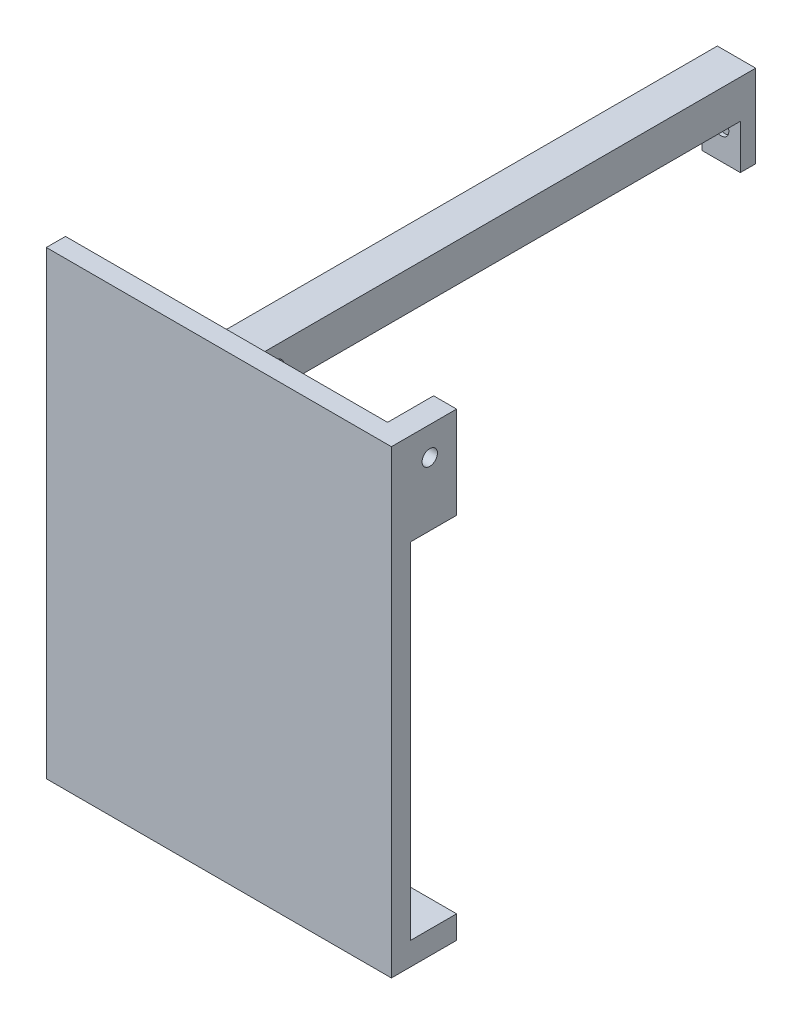
ISO-10303-21;
HEADER;
FILE_DESCRIPTION(('STEP AP214'),'2;1');
FILE_NAME('part.step','',(''),(''),'','','');
FILE_SCHEMA(('AUTOMOTIVE_DESIGN { 1 0 10303 214 1 1 1 1 }'));
ENDSEC;
DATA;
#1=APPLICATION_CONTEXT('core data for automotive mechanical design processes');
#2=APPLICATION_PROTOCOL_DEFINITION('international standard','automotive_design',2000,#1);
#3=PRODUCT_CONTEXT('',#1,'mechanical');
#4=PRODUCT('Part','Part','',(#3));
#5=PRODUCT_RELATED_PRODUCT_CATEGORY('part','',(#4));
#6=PRODUCT_DEFINITION_FORMATION('','',#4);
#7=PRODUCT_DEFINITION_CONTEXT('part definition',#1,'design');
#8=PRODUCT_DEFINITION('design','',#6,#7);
#9=PRODUCT_DEFINITION_SHAPE('','',#8);
#10=(LENGTH_UNIT() NAMED_UNIT(*) SI_UNIT(.MILLI.,.METRE.));
#11=(NAMED_UNIT(*) PLANE_ANGLE_UNIT() SI_UNIT($,.RADIAN.));
#12=(NAMED_UNIT(*) SI_UNIT($,.STERADIAN.) SOLID_ANGLE_UNIT());
#13=UNCERTAINTY_MEASURE_WITH_UNIT(LENGTH_MEASURE(1.E-05),#10,'distance_accuracy_value','');
#14=(GEOMETRIC_REPRESENTATION_CONTEXT(3) GLOBAL_UNCERTAINTY_ASSIGNED_CONTEXT((#13)) GLOBAL_UNIT_ASSIGNED_CONTEXT((#10,
#11,#12)) REPRESENTATION_CONTEXT('',''));
#15=CARTESIAN_POINT('',(0.,0.,0.));
#16=DIRECTION('',(0.,0.,1.));
#17=DIRECTION('',(1.,0.,0.));
#18=AXIS2_PLACEMENT_3D('',#15,#16,#17);
#19=CARTESIAN_POINT('',(0.,0.,650.));
#20=DIRECTION('',(0.,0.,1.));
#21=DIRECTION('',(1.,0.,0.));
#22=AXIS2_PLACEMENT_3D('',#19,#20,#21);
#23=PLANE('',#22);
#24=DIRECTION('',(-1.,0.,0.));
#25=VECTOR('',#24,1.);
#26=CARTESIAN_POINT('',(-35.2150537634409,27.1505376344086,650.));
#27=LINE('',#26,#25);
#28=CARTESIAN_POINT('',(14.7849462365591,27.1505376344086,650.));
#29=VERTEX_POINT('',#28);
#30=CARTESIAN_POINT('',(-35.2150537634409,27.1505376344086,650.));
#31=VERTEX_POINT('',#30);
#32=EDGE_CURVE('E356',#29,#31,#27,.T.);
#33=ORIENTED_EDGE('',*,*,#32,.T.);
#34=DIRECTION('',(0.,-1.,0.));
#35=VECTOR('',#34,1.);
#36=CARTESIAN_POINT('',(-35.2150537634409,27.1505376344086,650.));
#37=LINE('',#36,#35);
#38=CARTESIAN_POINT('',(-35.2150537634409,-22.8494623655914,650.));
#39=VERTEX_POINT('',#38);
#40=EDGE_CURVE('E343',#31,#39,#37,.T.);
#41=ORIENTED_EDGE('',*,*,#40,.T.);
#42=DIRECTION('',(1.,0.,0.));
#43=VECTOR('',#42,1.);
#44=CARTESIAN_POINT('',(-35.2150537634409,-22.8494623655914,650.));
#45=LINE('',#44,#43);
#46=CARTESIAN_POINT('',(14.7849462365592,-22.8494623655914,650.));
#47=VERTEX_POINT('',#46);
#48=EDGE_CURVE('E347',#39,#47,#45,.T.);
#49=ORIENTED_EDGE('',*,*,#48,.T.);
#50=DIRECTION('',(0.,1.,0.));
#51=VECTOR('',#50,1.);
#52=CARTESIAN_POINT('',(14.7849462365591,27.1505376344086,650.));
#53=LINE('',#52,#51);
#54=EDGE_CURVE('E352',#47,#29,#53,.T.);
#55=ORIENTED_EDGE('',*,*,#54,.T.);
#56=EDGE_LOOP('',(#33,#41,#49,#55));
#57=FACE_BOUND('',#56,.T.);
#58=CARTESIAN_POINT('',(-10.2150537634409,-41.8494623655914,650.));
#59=DIRECTION('',(0.,0.,1.));
#60=DIRECTION('',(1.,0.,0.));
#61=AXIS2_PLACEMENT_3D('',#58,#59,#60);
#62=CIRCLE('',#61,10.);
#63=CARTESIAN_POINT('',(-0.215053763440852,-41.8494623655914,650.));
#64=VERTEX_POINT('',#63);
#65=EDGE_CURVE('E208',#64,#64,#62,.F.);
#66=ORIENTED_EDGE('',*,*,#65,.F.);
#67=EDGE_LOOP('',(#66));
#68=FACE_BOUND('',#67,.T.);
#69=DIRECTION('',(0.,1.,0.));
#70=VECTOR('',#69,1.);
#71=CARTESIAN_POINT('',(184.784946236559,-52.8494623655914,650.));
#72=LINE('',#71,#70);
#73=CARTESIAN_POINT('',(184.784946236559,-52.8494623655914,650.));
#74=VERTEX_POINT('',#73);
#75=CARTESIAN_POINT('',(184.784946236559,37.1505376344087,650.));
#76=VERTEX_POINT('',#75);
#77=EDGE_CURVE('E170',#74,#76,#72,.T.);
#78=ORIENTED_EDGE('',*,*,#77,.F.);
#79=DIRECTION('',(1.,0.,0.));
#80=VECTOR('',#79,1.);
#81=CARTESIAN_POINT('',(214.784946236559,-52.8494623655914,650.));
#82=LINE('',#81,#80);
#83=CARTESIAN_POINT('',(-235.215053763441,-52.8494623655914,650.));
#84=VERTEX_POINT('',#83);
#85=EDGE_CURVE('E262',#84,#74,#82,.T.);
#86=ORIENTED_EDGE('',*,*,#85,.F.);
#87=DIRECTION('',(0.,-1.,0.));
#88=VECTOR('',#87,1.);
#89=CARTESIAN_POINT('',(-235.215053763441,37.1505376344086,650.));
#90=LINE('',#89,#88);
#91=CARTESIAN_POINT('',(-235.215053763441,37.1505376344086,650.));
#92=VERTEX_POINT('',#91);
#93=EDGE_CURVE('E321',#92,#84,#90,.T.);
#94=ORIENTED_EDGE('',*,*,#93,.F.);
#95=DIRECTION('',(-1.,0.,0.));
#96=VECTOR('',#95,1.);
#97=CARTESIAN_POINT('',(-235.215053763441,37.1505376344086,650.));
#98=LINE('',#97,#96);
#99=EDGE_CURVE('E311',#76,#92,#98,.T.);
#100=ORIENTED_EDGE('',*,*,#99,.F.);
#101=EDGE_LOOP('',(#78,#86,#94,#100));
#102=FACE_BOUND('',#101,.T.);
#103=ADVANCED_FACE('F46',(#57,#68,#102),#23,.F.);
#104=CARTESIAN_POINT('',(214.784946236559,-52.8494623655914,590.));
#105=DIRECTION('',(0.,-1.,0.));
#106=DIRECTION('',(0.,0.,-1.));
#107=AXIS2_PLACEMENT_3D('',#104,#105,#106);
#108=PLANE('',#107);
#109=CARTESIAN_POINT('',(-10.2150537634408,-52.8494623655914,625.));
#110=DIRECTION('',(0.,-1.,0.));
#111=DIRECTION('',(0.,0.,-1.));
#112=AXIS2_PLACEMENT_3D('',#109,#110,#111);
#113=CIRCLE('',#112,10.);
#114=CARTESIAN_POINT('',(-10.2150537634408,-52.8494623655914,615.));
#115=VERTEX_POINT('',#114);
#116=EDGE_CURVE('E240',#115,#115,#113,.F.);
#117=ORIENTED_EDGE('',*,*,#116,.F.);
#118=EDGE_LOOP('',(#117));
#119=FACE_BOUND('',#118,.T.);
#120=DIRECTION('',(0.,0.,1.));
#121=VECTOR('',#120,1.);
#122=CARTESIAN_POINT('',(184.784946236559,-52.8494623655914,495.131670194949));
#123=LINE('',#122,#121);
#124=CARTESIAN_POINT('',(184.784946236559,-52.8494623655914,590.));
#125=VERTEX_POINT('',#124);
#126=EDGE_CURVE('E200',#125,#74,#123,.T.);
#127=ORIENTED_EDGE('',*,*,#126,.F.);
#128=DIRECTION('',(1.,0.,0.));
#129=VECTOR('',#128,1.);
#130=CARTESIAN_POINT('',(214.784946236559,-52.8494623655914,590.));
#131=LINE('',#130,#129);
#132=CARTESIAN_POINT('',(-235.215053763441,-52.8494623655914,590.));
#133=VERTEX_POINT('',#132);
#134=EDGE_CURVE('E189',#133,#125,#131,.T.);
#135=ORIENTED_EDGE('',*,*,#134,.F.);
#136=DIRECTION('',(0.,0.,1.));
#137=VECTOR('',#136,1.);
#138=CARTESIAN_POINT('',(-235.215053763441,-52.8494623655914,590.));
#139=LINE('',#138,#137);
#140=EDGE_CURVE('E259',#133,#84,#139,.T.);
#141=ORIENTED_EDGE('',*,*,#140,.T.);
#142=ORIENTED_EDGE('',*,*,#85,.T.);
#143=EDGE_LOOP('',(#127,#135,#141,#142));
#144=FACE_BOUND('',#143,.T.);
#145=ADVANCED_FACE('F422',(#119,#144),#108,.F.);
#146=CARTESIAN_POINT('',(-35.2150537634409,-22.8494623655914,650.));
#147=DIRECTION('',(0.,1.,0.));
#148=DIRECTION('',(0.,0.,1.));
#149=AXIS2_PLACEMENT_3D('',#146,#147,#148);
#150=PLANE('',#149);
#151=DIRECTION('',(-1.,0.,0.));
#152=VECTOR('',#151,1.);
#153=CARTESIAN_POINT('',(-35.2150537634409,-22.8494623655914,20.));
#154=LINE('',#153,#152);
#155=CARTESIAN_POINT('',(14.7849462365592,-22.8494623655914,20.));
#156=VERTEX_POINT('',#155);
#157=CARTESIAN_POINT('',(-35.2150537634409,-22.8494623655914,20.));
#158=VERTEX_POINT('',#157);
#159=EDGE_CURVE('E66',#156,#158,#154,.T.);
#160=ORIENTED_EDGE('',*,*,#159,.F.);
#161=DIRECTION('',(0.,0.,-1.));
#162=VECTOR('',#161,1.);
#163=CARTESIAN_POINT('',(14.7849462365592,-22.8494623655914,650.));
#164=LINE('',#163,#162);
#165=EDGE_CURVE('E56',#47,#156,#164,.T.);
#166=ORIENTED_EDGE('',*,*,#165,.F.);
#167=ORIENTED_EDGE('',*,*,#48,.F.);
#168=DIRECTION('',(0.,0.,-1.));
#169=VECTOR('',#168,1.);
#170=CARTESIAN_POINT('',(-35.2150537634409,-22.8494623655914,650.));
#171=LINE('',#170,#169);
#172=EDGE_CURVE('E11',#39,#158,#171,.T.);
#173=ORIENTED_EDGE('',*,*,#172,.T.);
#174=EDGE_LOOP('',(#160,#166,#167,#173));
#175=FACE_BOUND('',#174,.T.);
#176=ADVANCED_FACE('F400',(#175),#150,.F.);
#177=DIRECTION('',(-1.,0.,0.));
#178=VECTOR('',#177,1.);
#179=CARTESIAN_POINT('',(214.784946236559,-82.8494623655914,650.));
#180=LINE('',#179,#178);
#181=CARTESIAN_POINT('',(214.784946236559,-82.8494623655914,650.));
#182=VERTEX_POINT('',#181);
#183=CARTESIAN_POINT('',(-235.215053763441,-82.8494623655914,650.));
#184=VERTEX_POINT('',#183);
#185=EDGE_CURVE('E266',#182,#184,#180,.T.);
#186=ORIENTED_EDGE('',*,*,#185,.F.);
#187=DIRECTION('',(0.,1.,0.));
#188=VECTOR('',#187,1.);
#189=CARTESIAN_POINT('',(214.784946236559,37.1505376344087,650.));
#190=LINE('',#189,#188);
#191=CARTESIAN_POINT('',(214.784946236559,-532.849462365591,650.));
#192=VERTEX_POINT('',#191);
#193=EDGE_CURVE('E325',#192,#182,#190,.T.);
#194=ORIENTED_EDGE('',*,*,#193,.F.);
#195=DIRECTION('',(1.,0.,0.));
#196=VECTOR('',#195,1.);
#197=CARTESIAN_POINT('',(214.784946236559,-532.849462365591,650.));
#198=LINE('',#197,#196);
#199=CARTESIAN_POINT('',(-235.215053763441,-532.849462365591,650.));
#200=VERTEX_POINT('',#199);
#201=EDGE_CURVE('E270',#200,#192,#198,.T.);
#202=ORIENTED_EDGE('',*,*,#201,.F.);
#203=EDGE_CURVE('E305',#184,#200,#90,.T.);
#204=ORIENTED_EDGE('',*,*,#203,.F.);
#205=EDGE_LOOP('',(#186,#194,#202,#204));
#206=FACE_BOUND('',#205,.T.);
#207=ADVANCED_FACE('F424',(#206),#23,.F.);
#208=CARTESIAN_POINT('',(-35.2150537634409,27.1505376344086,650.));
#209=DIRECTION('',(1.,0.,0.));
#210=DIRECTION('',(0.,0.,-1.));
#211=AXIS2_PLACEMENT_3D('',#208,#209,#210);
#212=PLANE('',#211);
#213=DIRECTION('',(0.,-1.,0.));
#214=VECTOR('',#213,1.);
#215=CARTESIAN_POINT('',(-35.2150537634409,27.1505376344086,0.));
#216=LINE('',#215,#214);
#217=CARTESIAN_POINT('',(-35.2150537634409,27.1505376344086,0.));
#218=VERTEX_POINT('',#217);
#219=CARTESIAN_POINT('',(-35.2150537634409,-80.8494623655914,0.));
#220=VERTEX_POINT('',#219);
#221=EDGE_CURVE('E342',#218,#220,#216,.T.);
#222=ORIENTED_EDGE('',*,*,#221,.T.);
#223=DIRECTION('',(0.,0.,-1.));
#224=VECTOR('',#223,1.);
#225=CARTESIAN_POINT('',(-35.2150537634409,-80.8494623655914,0.));
#226=LINE('',#225,#224);
#227=CARTESIAN_POINT('',(-35.2150537634409,-80.8494623655914,20.));
#228=VERTEX_POINT('',#227);
#229=EDGE_CURVE('E212',#228,#220,#226,.T.);
#230=ORIENTED_EDGE('',*,*,#229,.F.);
#231=DIRECTION('',(0.,1.,0.));
#232=VECTOR('',#231,1.);
#233=CARTESIAN_POINT('',(-35.2150537634409,-80.8494623655914,20.));
#234=LINE('',#233,#232);
#235=EDGE_CURVE('E226',#228,#158,#234,.T.);
#236=ORIENTED_EDGE('',*,*,#235,.T.);
#237=ORIENTED_EDGE('',*,*,#172,.F.);
#238=ORIENTED_EDGE('',*,*,#40,.F.);
#239=DIRECTION('',(0.,0.,-1.));
#240=VECTOR('',#239,1.);
#241=CARTESIAN_POINT('',(-35.2150537634409,27.1505376344086,650.));
#242=LINE('',#241,#240);
#243=EDGE_CURVE('E360',#31,#218,#242,.T.);
#244=ORIENTED_EDGE('',*,*,#243,.T.);
#245=EDGE_LOOP('',(#222,#230,#236,#237,#238,#244));
#246=FACE_BOUND('',#245,.T.);
#247=ADVANCED_FACE('F48',(#246),#212,.F.);
#248=CARTESIAN_POINT('',(14.7849462365591,27.1505376344086,650.));
#249=DIRECTION('',(-1.,0.,0.));
#250=DIRECTION('',(0.,-1.,0.));
#251=AXIS2_PLACEMENT_3D('',#248,#249,#250);
#252=PLANE('',#251);
#253=CARTESIAN_POINT('',(14.7849462365591,0.,625.));
#254=DIRECTION('',(-1.,0.,0.));
#255=DIRECTION('',(0.,-1.,0.));
#256=AXIS2_PLACEMENT_3D('',#253,#254,#255);
#257=CIRCLE('',#256,9.99999999999998);
#258=CARTESIAN_POINT('',(14.7849462365592,-9.99999999999998,625.));
#259=VERTEX_POINT('',#258);
#260=EDGE_CURVE('E202',#259,#259,#257,.T.);
#261=ORIENTED_EDGE('',*,*,#260,.T.);
#262=EDGE_LOOP('',(#261));
#263=FACE_BOUND('',#262,.T.);
#264=DIRECTION('',(0.,1.,0.));
#265=VECTOR('',#264,1.);
#266=CARTESIAN_POINT('',(14.7849462365591,27.1505376344086,0.));
#267=LINE('',#266,#265);
#268=CARTESIAN_POINT('',(14.7849462365592,-80.8494623655914,0.));
#269=VERTEX_POINT('',#268);
#270=CARTESIAN_POINT('',(14.7849462365591,27.1505376344086,0.));
#271=VERTEX_POINT('',#270);
#272=EDGE_CURVE('E363',#269,#271,#267,.T.);
#273=ORIENTED_EDGE('',*,*,#272,.T.);
#274=DIRECTION('',(0.,0.,-1.));
#275=VECTOR('',#274,1.);
#276=CARTESIAN_POINT('',(14.7849462365591,27.1505376344086,650.));
#277=LINE('',#276,#275);
#278=EDGE_CURVE('E371',#29,#271,#277,.T.);
#279=ORIENTED_EDGE('',*,*,#278,.F.);
#280=ORIENTED_EDGE('',*,*,#54,.F.);
#281=ORIENTED_EDGE('',*,*,#165,.T.);
#282=DIRECTION('',(0.,1.,0.));
#283=VECTOR('',#282,1.);
#284=CARTESIAN_POINT('',(14.7849462365592,-80.8494623655914,20.));
#285=LINE('',#284,#283);
#286=CARTESIAN_POINT('',(14.7849462365592,-80.8494623655914,20.));
#287=VERTEX_POINT('',#286);
#288=EDGE_CURVE('E232',#287,#156,#285,.T.);
#289=ORIENTED_EDGE('',*,*,#288,.F.);
#290=DIRECTION('',(0.,0.,1.));
#291=VECTOR('',#290,1.);
#292=CARTESIAN_POINT('',(14.7849462365592,-80.8494623655914,0.));
#293=LINE('',#292,#291);
#294=EDGE_CURVE('E220',#269,#287,#293,.T.);
#295=ORIENTED_EDGE('',*,*,#294,.F.);
#296=EDGE_LOOP('',(#273,#279,#280,#281,#289,#295));
#297=FACE_BOUND('',#296,.T.);
#298=ADVANCED_FACE('F398',(#263,#297),#252,.F.);
#299=CARTESIAN_POINT('',(-35.2150537634409,27.1505376344086,650.));
#300=DIRECTION('',(0.,-1.,0.));
#301=DIRECTION('',(0.,0.,-1.));
#302=AXIS2_PLACEMENT_3D('',#299,#300,#301);
#303=PLANE('',#302);
#304=DIRECTION('',(-1.,0.,0.));
#305=VECTOR('',#304,1.);
#306=CARTESIAN_POINT('',(-35.2150537634409,27.1505376344086,0.));
#307=LINE('',#306,#305);
#308=EDGE_CURVE('E348',#271,#218,#307,.T.);
#309=ORIENTED_EDGE('',*,*,#308,.T.);
#310=ORIENTED_EDGE('',*,*,#243,.F.);
#311=ORIENTED_EDGE('',*,*,#32,.F.);
#312=ORIENTED_EDGE('',*,*,#278,.T.);
#313=EDGE_LOOP('',(#309,#310,#311,#312));
#314=FACE_BOUND('',#313,.T.);
#315=ADVANCED_FACE('F406',(#314),#303,.F.);
#316=CARTESIAN_POINT('',(0.,0.,0.));
#317=DIRECTION('',(0.,0.,1.));
#318=DIRECTION('',(1.,0.,0.));
#319=AXIS2_PLACEMENT_3D('',#316,#317,#318);
#320=PLANE('',#319);
#321=ORIENTED_EDGE('',*,*,#221,.F.);
#322=ORIENTED_EDGE('',*,*,#308,.F.);
#323=ORIENTED_EDGE('',*,*,#272,.F.);
#324=DIRECTION('',(1.,0.,0.));
#325=VECTOR('',#324,1.);
#326=CARTESIAN_POINT('',(-35.2150537634409,-80.8494623655914,0.));
#327=LINE('',#326,#325);
#328=EDGE_CURVE('E216',#220,#269,#327,.T.);
#329=ORIENTED_EDGE('',*,*,#328,.F.);
#330=EDGE_LOOP('',(#321,#322,#323,#329));
#331=FACE_BOUND('',#330,.T.);
#332=ADVANCED_FACE('F409',(#331),#320,.F.);
#333=CARTESIAN_POINT('',(-235.215053763441,37.1505376344086,675.));
#334=DIRECTION('',(1.,0.,0.));
#335=DIRECTION('',(0.,1.,0.));
#336=AXIS2_PLACEMENT_3D('',#333,#334,#335);
#337=PLANE('',#336);
#338=ORIENTED_EDGE('',*,*,#93,.T.);
#339=ORIENTED_EDGE('',*,*,#140,.F.);
#340=DIRECTION('',(0.,1.,0.));
#341=VECTOR('',#340,1.);
#342=CARTESIAN_POINT('',(-235.215053763441,-52.8494623655914,590.));
#343=LINE('',#342,#341);
#344=CARTESIAN_POINT('',(-235.215053763441,-82.8494623655914,590.));
#345=VERTEX_POINT('',#344);
#346=EDGE_CURVE('E273',#345,#133,#343,.T.);
#347=ORIENTED_EDGE('',*,*,#346,.F.);
#348=DIRECTION('',(0.,0.,1.));
#349=VECTOR('',#348,1.);
#350=CARTESIAN_POINT('',(-235.215053763441,-82.8494623655914,590.));
#351=LINE('',#350,#349);
#352=EDGE_CURVE('E255',#345,#184,#351,.T.);
#353=ORIENTED_EDGE('',*,*,#352,.T.);
#354=ORIENTED_EDGE('',*,*,#203,.T.);
#355=DIRECTION('',(0.,0.,1.));
#356=VECTOR('',#355,1.);
#357=CARTESIAN_POINT('',(-235.215053763441,-532.849462365591,590.));
#358=LINE('',#357,#356);
#359=CARTESIAN_POINT('',(-235.215053763441,-532.849462365591,590.));
#360=VERTEX_POINT('',#359);
#361=EDGE_CURVE('E301',#360,#200,#358,.T.);
#362=ORIENTED_EDGE('',*,*,#361,.F.);
#363=DIRECTION('',(0.,1.,0.));
#364=VECTOR('',#363,1.);
#365=CARTESIAN_POINT('',(-235.215053763441,-562.849462365591,590.));
#366=LINE('',#365,#364);
#367=CARTESIAN_POINT('',(-235.215053763441,-562.849462365591,590.));
#368=VERTEX_POINT('',#367);
#369=EDGE_CURVE('E289',#368,#360,#366,.T.);
#370=ORIENTED_EDGE('',*,*,#369,.F.);
#371=DIRECTION('',(0.,0.,-1.));
#372=VECTOR('',#371,1.);
#373=CARTESIAN_POINT('',(-235.215053763441,-562.849462365591,675.));
#374=LINE('',#373,#372);
#375=CARTESIAN_POINT('',(-235.215053763441,-562.849462365591,675.));
#376=VERTEX_POINT('',#375);
#377=EDGE_CURVE('E339',#376,#368,#374,.T.);
#378=ORIENTED_EDGE('',*,*,#377,.F.);
#379=DIRECTION('',(0.,-1.,0.));
#380=VECTOR('',#379,1.);
#381=CARTESIAN_POINT('',(-235.215053763441,37.1505376344086,675.));
#382=LINE('',#381,#380);
#383=CARTESIAN_POINT('',(-235.215053763441,37.1505376344086,675.));
#384=VERTEX_POINT('',#383);
#385=EDGE_CURVE('E306',#384,#376,#382,.T.);
#386=ORIENTED_EDGE('',*,*,#385,.F.);
#387=DIRECTION('',(0.,0.,-1.));
#388=VECTOR('',#387,1.);
#389=CARTESIAN_POINT('',(-235.215053763441,37.1505376344086,675.));
#390=LINE('',#389,#388);
#391=EDGE_CURVE('E320',#384,#92,#390,.T.);
#392=ORIENTED_EDGE('',*,*,#391,.T.);
#393=EDGE_LOOP('',(#338,#339,#347,#353,#354,#362,#370,#378,#386,#392));
#394=FACE_BOUND('',#393,.T.);
#395=ADVANCED_FACE('F411',(#394),#337,.F.);
#396=CARTESIAN_POINT('',(-235.215053763441,-562.849462365591,675.));
#397=DIRECTION('',(0.,1.,0.));
#398=DIRECTION('',(0.,0.,1.));
#399=AXIS2_PLACEMENT_3D('',#396,#397,#398);
#400=PLANE('',#399);
#401=CARTESIAN_POINT('',(-10.2150537634408,-562.849462365591,625.));
#402=DIRECTION('',(0.,-1.,0.));
#403=DIRECTION('',(0.,0.,-1.));
#404=AXIS2_PLACEMENT_3D('',#401,#402,#403);
#405=CIRCLE('',#404,10.);
#406=CARTESIAN_POINT('',(-10.2150537634408,-562.849462365591,615.));
#407=VERTEX_POINT('',#406);
#408=EDGE_CURVE('E236',#407,#407,#405,.T.);
#409=ORIENTED_EDGE('',*,*,#408,.F.);
#410=EDGE_LOOP('',(#409));
#411=FACE_BOUND('',#410,.T.);
#412=ORIENTED_EDGE('',*,*,#377,.T.);
#413=DIRECTION('',(-1.,0.,0.));
#414=VECTOR('',#413,1.);
#415=CARTESIAN_POINT('',(214.784946236559,-562.849462365591,590.));
#416=LINE('',#415,#414);
#417=CARTESIAN_POINT('',(214.784946236559,-562.849462365591,590.));
#418=VERTEX_POINT('',#417);
#419=EDGE_CURVE('E285',#418,#368,#416,.T.);
#420=ORIENTED_EDGE('',*,*,#419,.F.);
#421=DIRECTION('',(0.,0.,-1.));
#422=VECTOR('',#421,1.);
#423=CARTESIAN_POINT('',(214.784946236559,-562.849462365591,675.));
#424=LINE('',#423,#422);
#425=CARTESIAN_POINT('',(214.784946236559,-562.849462365591,675.));
#426=VERTEX_POINT('',#425);
#427=EDGE_CURVE('E336',#426,#418,#424,.T.);
#428=ORIENTED_EDGE('',*,*,#427,.F.);
#429=DIRECTION('',(1.,0.,0.));
#430=VECTOR('',#429,1.);
#431=CARTESIAN_POINT('',(-235.215053763441,-562.849462365591,675.));
#432=LINE('',#431,#430);
#433=EDGE_CURVE('E310',#376,#426,#432,.T.);
#434=ORIENTED_EDGE('',*,*,#433,.F.);
#435=EDGE_LOOP('',(#412,#420,#428,#434));
#436=FACE_BOUND('',#435,.T.);
#437=ADVANCED_FACE('F417',(#411,#436),#400,.F.);
#438=CARTESIAN_POINT('',(214.784946236559,37.1505376344087,675.));
#439=DIRECTION('',(-1.,0.,0.));
#440=DIRECTION('',(0.,-1.,0.));
#441=AXIS2_PLACEMENT_3D('',#438,#439,#440);
#442=PLANE('',#441);
#443=CARTESIAN_POINT('',(214.784946236559,0.,625.));
#444=DIRECTION('',(1.,0.,0.));
#445=DIRECTION('',(0.,1.,0.));
#446=AXIS2_PLACEMENT_3D('',#443,#444,#445);
#447=CIRCLE('',#446,9.99999999999998);
#448=CARTESIAN_POINT('',(214.784946236559,10.,625.));
#449=VERTEX_POINT('',#448);
#450=EDGE_CURVE('E537',#449,#449,#447,.T.);
#451=ORIENTED_EDGE('',*,*,#450,.F.);
#452=EDGE_LOOP('',(#451));
#453=FACE_BOUND('',#452,.T.);
#454=DIRECTION('',(0.,-1.,0.));
#455=VECTOR('',#454,1.);
#456=CARTESIAN_POINT('',(214.784946236559,-52.8494623655914,590.));
#457=LINE('',#456,#455);
#458=CARTESIAN_POINT('',(214.784946236559,37.1505376344087,590.));
#459=VERTEX_POINT('',#458);
#460=CARTESIAN_POINT('',(214.784946236559,-82.8494623655914,590.));
#461=VERTEX_POINT('',#460);
#462=EDGE_CURVE('E267',#459,#461,#457,.T.);
#463=ORIENTED_EDGE('',*,*,#462,.F.);
#464=DIRECTION('',(0.,0.,-1.));
#465=VECTOR('',#464,1.);
#466=CARTESIAN_POINT('',(214.784946236559,37.1505376344087,675.));
#467=LINE('',#466,#465);
#468=CARTESIAN_POINT('',(214.784946236559,37.1505376344087,675.));
#469=VERTEX_POINT('',#468);
#470=EDGE_CURVE('E180',#469,#459,#467,.T.);
#471=ORIENTED_EDGE('',*,*,#470,.F.);
#472=DIRECTION('',(0.,1.,0.));
#473=VECTOR('',#472,1.);
#474=CARTESIAN_POINT('',(214.784946236559,37.1505376344087,675.));
#475=LINE('',#474,#473);
#476=EDGE_CURVE('E314',#426,#469,#475,.T.);
#477=ORIENTED_EDGE('',*,*,#476,.F.);
#478=ORIENTED_EDGE('',*,*,#427,.T.);
#479=DIRECTION('',(0.,-1.,0.));
#480=VECTOR('',#479,1.);
#481=CARTESIAN_POINT('',(214.784946236559,-562.849462365591,590.));
#482=LINE('',#481,#480);
#483=CARTESIAN_POINT('',(214.784946236559,-532.849462365591,590.));
#484=VERTEX_POINT('',#483);
#485=EDGE_CURVE('E281',#484,#418,#482,.T.);
#486=ORIENTED_EDGE('',*,*,#485,.F.);
#487=DIRECTION('',(0.,0.,1.));
#488=VECTOR('',#487,1.);
#489=CARTESIAN_POINT('',(214.784946236559,-532.849462365591,590.));
#490=LINE('',#489,#488);
#491=EDGE_CURVE('E295',#484,#192,#490,.T.);
#492=ORIENTED_EDGE('',*,*,#491,.T.);
#493=ORIENTED_EDGE('',*,*,#193,.T.);
#494=DIRECTION('',(0.,0.,1.));
#495=VECTOR('',#494,1.);
#496=CARTESIAN_POINT('',(214.784946236559,-82.8494623655914,590.));
#497=LINE('',#496,#495);
#498=EDGE_CURVE('E252',#461,#182,#497,.T.);
#499=ORIENTED_EDGE('',*,*,#498,.F.);
#500=EDGE_LOOP('',(#463,#471,#477,#478,#486,#492,#493,#499));
#501=FACE_BOUND('',#500,.T.);
#502=ADVANCED_FACE('F446',(#453,#501),#442,.F.);
#503=CARTESIAN_POINT('',(-235.215053763441,37.1505376344086,675.));
#504=DIRECTION('',(0.,-1.,0.));
#505=DIRECTION('',(1.,0.,0.));
#506=AXIS2_PLACEMENT_3D('',#503,#504,#505);
#507=PLANE('',#506);
#508=ORIENTED_EDGE('',*,*,#470,.T.);
#509=DIRECTION('',(1.,0.,0.));
#510=VECTOR('',#509,1.);
#511=CARTESIAN_POINT('',(214.784946236559,37.1505376344087,590.));
#512=LINE('',#511,#510);
#513=CARTESIAN_POINT('',(184.784946236559,37.1505376344087,590.));
#514=VERTEX_POINT('',#513);
#515=EDGE_CURVE('E174',#514,#459,#512,.T.);
#516=ORIENTED_EDGE('',*,*,#515,.F.);
#517=DIRECTION('',(0.,0.,1.));
#518=VECTOR('',#517,1.);
#519=CARTESIAN_POINT('',(184.784946236559,37.1505376344087,495.131670194949));
#520=LINE('',#519,#518);
#521=EDGE_CURVE('E163',#514,#76,#520,.T.);
#522=ORIENTED_EDGE('',*,*,#521,.T.);
#523=ORIENTED_EDGE('',*,*,#99,.T.);
#524=ORIENTED_EDGE('',*,*,#391,.F.);
#525=DIRECTION('',(-1.,0.,0.));
#526=VECTOR('',#525,1.);
#527=CARTESIAN_POINT('',(-235.215053763441,37.1505376344086,675.));
#528=LINE('',#527,#526);
#529=EDGE_CURVE('E317',#469,#384,#528,.T.);
#530=ORIENTED_EDGE('',*,*,#529,.F.);
#531=EDGE_LOOP('',(#508,#516,#522,#523,#524,#530));
#532=FACE_BOUND('',#531,.T.);
#533=ADVANCED_FACE('F177',(#532),#507,.F.);
#534=CARTESIAN_POINT('',(0.,0.,675.));
#535=DIRECTION('',(0.,0.,1.));
#536=DIRECTION('',(1.,0.,0.));
#537=AXIS2_PLACEMENT_3D('',#534,#535,#536);
#538=PLANE('',#537);
#539=ORIENTED_EDGE('',*,*,#385,.T.);
#540=ORIENTED_EDGE('',*,*,#433,.T.);
#541=ORIENTED_EDGE('',*,*,#476,.T.);
#542=ORIENTED_EDGE('',*,*,#529,.T.);
#543=EDGE_LOOP('',(#539,#540,#541,#542));
#544=FACE_BOUND('',#543,.T.);
#545=ADVANCED_FACE('F463',(#544),#538,.T.);
#546=CARTESIAN_POINT('',(214.784946236559,-532.849462365591,590.));
#547=DIRECTION('',(0.,-1.,0.));
#548=DIRECTION('',(0.,0.,-1.));
#549=AXIS2_PLACEMENT_3D('',#546,#547,#548);
#550=PLANE('',#549);
#551=CARTESIAN_POINT('',(-10.2150537634408,-532.849462365591,625.));
#552=DIRECTION('',(0.,-1.,0.));
#553=DIRECTION('',(0.,0.,-1.));
#554=AXIS2_PLACEMENT_3D('',#551,#552,#553);
#555=CIRCLE('',#554,10.);
#556=CARTESIAN_POINT('',(-10.2150537634408,-532.849462365591,615.));
#557=VERTEX_POINT('',#556);
#558=EDGE_CURVE('E248',#557,#557,#555,.T.);
#559=ORIENTED_EDGE('',*,*,#558,.T.);
#560=EDGE_LOOP('',(#559));
#561=FACE_BOUND('',#560,.T.);
#562=ORIENTED_EDGE('',*,*,#201,.T.);
#563=ORIENTED_EDGE('',*,*,#491,.F.);
#564=DIRECTION('',(1.,0.,0.));
#565=VECTOR('',#564,1.);
#566=CARTESIAN_POINT('',(214.784946236559,-532.849462365591,590.));
#567=LINE('',#566,#565);
#568=EDGE_CURVE('E292',#360,#484,#567,.T.);
#569=ORIENTED_EDGE('',*,*,#568,.F.);
#570=ORIENTED_EDGE('',*,*,#361,.T.);
#571=EDGE_LOOP('',(#562,#563,#569,#570));
#572=FACE_BOUND('',#571,.T.);
#573=ADVANCED_FACE('F451',(#561,#572),#550,.F.);
#574=CARTESIAN_POINT('',(0.,0.,590.));
#575=DIRECTION('',(0.,0.,1.));
#576=DIRECTION('',(1.,0.,0.));
#577=AXIS2_PLACEMENT_3D('',#574,#575,#576);
#578=PLANE('',#577);
#579=ORIENTED_EDGE('',*,*,#485,.T.);
#580=ORIENTED_EDGE('',*,*,#419,.T.);
#581=ORIENTED_EDGE('',*,*,#369,.T.);
#582=ORIENTED_EDGE('',*,*,#568,.T.);
#583=EDGE_LOOP('',(#579,#580,#581,#582));
#584=FACE_BOUND('',#583,.T.);
#585=ADVANCED_FACE('F468',(#584),#578,.F.);
#586=CARTESIAN_POINT('',(214.784946236559,-82.8494623655914,590.));
#587=DIRECTION('',(0.,1.,0.));
#588=DIRECTION('',(0.,0.,1.));
#589=AXIS2_PLACEMENT_3D('',#586,#587,#588);
#590=PLANE('',#589);
#591=CARTESIAN_POINT('',(-10.2150537634408,-82.8494623655914,625.));
#592=DIRECTION('',(0.,1.,0.));
#593=DIRECTION('',(0.,0.,1.));
#594=AXIS2_PLACEMENT_3D('',#591,#592,#593);
#595=CIRCLE('',#594,10.);
#596=CARTESIAN_POINT('',(-10.2150537634408,-82.8494623655914,635.));
#597=VERTEX_POINT('',#596);
#598=EDGE_CURVE('E244',#597,#597,#595,.T.);
#599=ORIENTED_EDGE('',*,*,#598,.T.);
#600=EDGE_LOOP('',(#599));
#601=FACE_BOUND('',#600,.T.);
#602=ORIENTED_EDGE('',*,*,#185,.T.);
#603=ORIENTED_EDGE('',*,*,#352,.F.);
#604=DIRECTION('',(-1.,0.,0.));
#605=VECTOR('',#604,1.);
#606=CARTESIAN_POINT('',(214.784946236559,-82.8494623655914,590.));
#607=LINE('',#606,#605);
#608=EDGE_CURVE('E276',#461,#345,#607,.T.);
#609=ORIENTED_EDGE('',*,*,#608,.F.);
#610=ORIENTED_EDGE('',*,*,#498,.T.);
#611=EDGE_LOOP('',(#602,#603,#609,#610));
#612=FACE_BOUND('',#611,.T.);
#613=ADVANCED_FACE('F458',(#601,#612),#590,.F.);
#614=CARTESIAN_POINT('',(0.,0.,590.));
#615=DIRECTION('',(0.,0.,-1.));
#616=DIRECTION('',(-1.,0.,0.));
#617=AXIS2_PLACEMENT_3D('',#614,#615,#616);
#618=PLANE('',#617);
#619=ORIENTED_EDGE('',*,*,#462,.T.);
#620=ORIENTED_EDGE('',*,*,#608,.T.);
#621=ORIENTED_EDGE('',*,*,#346,.T.);
#622=ORIENTED_EDGE('',*,*,#134,.T.);
#623=DIRECTION('',(0.,1.,0.));
#624=VECTOR('',#623,1.);
#625=CARTESIAN_POINT('',(184.784946236559,-52.8494623655914,590.));
#626=LINE('',#625,#624);
#627=EDGE_CURVE('E167',#125,#514,#626,.T.);
#628=ORIENTED_EDGE('',*,*,#627,.T.);
#629=ORIENTED_EDGE('',*,*,#515,.T.);
#630=EDGE_LOOP('',(#619,#620,#621,#622,#628,#629));
#631=FACE_BOUND('',#630,.T.);
#632=ADVANCED_FACE('F187',(#631),#618,.T.);
#633=CARTESIAN_POINT('',(-10.2150537634408,-24.5651911181294,625.));
#634=DIRECTION('',(0.,-1.,0.));
#635=DIRECTION('',(0.,0.,-1.));
#636=AXIS2_PLACEMENT_3D('',#633,#634,#635);
#637=CYLINDRICAL_SURFACE('',#636,10.);
#638=ORIENTED_EDGE('',*,*,#116,.T.);
#639=EDGE_LOOP('',(#638));
#640=FACE_BOUND('',#639,.T.);
#641=ORIENTED_EDGE('',*,*,#598,.F.);
#642=EDGE_LOOP('',(#641));
#643=FACE_BOUND('',#642,.T.);
#644=ADVANCED_FACE('F498',(#640,#643),#637,.F.);
#645=ORIENTED_EDGE('',*,*,#408,.T.);
#646=EDGE_LOOP('',(#645));
#647=FACE_BOUND('',#646,.T.);
#648=ORIENTED_EDGE('',*,*,#558,.F.);
#649=EDGE_LOOP('',(#648));
#650=FACE_BOUND('',#649,.T.);
#651=ADVANCED_FACE('F386',(#647,#650),#637,.F.);
#652=CARTESIAN_POINT('',(-35.2150537634409,-80.8494623655914,20.));
#653=DIRECTION('',(0.,0.,-1.));
#654=DIRECTION('',(-1.,0.,0.));
#655=AXIS2_PLACEMENT_3D('',#652,#653,#654);
#656=PLANE('',#655);
#657=CARTESIAN_POINT('',(-10.2150537634409,-41.8494623655914,20.));
#658=DIRECTION('',(0.,0.,-1.));
#659=DIRECTION('',(-1.,0.,0.));
#660=AXIS2_PLACEMENT_3D('',#657,#658,#659);
#661=CIRCLE('',#660,10.);
#662=CARTESIAN_POINT('',(-20.2150537634409,-41.8494623655914,20.));
#663=VERTEX_POINT('',#662);
#664=EDGE_CURVE('E207',#663,#663,#661,.F.);
#665=ORIENTED_EDGE('',*,*,#664,.F.);
#666=EDGE_LOOP('',(#665));
#667=FACE_BOUND('',#666,.T.);
#668=ORIENTED_EDGE('',*,*,#159,.T.);
#669=ORIENTED_EDGE('',*,*,#235,.F.);
#670=DIRECTION('',(-1.,0.,0.));
#671=VECTOR('',#670,1.);
#672=CARTESIAN_POINT('',(-35.2150537634409,-80.8494623655914,20.));
#673=LINE('',#672,#671);
#674=EDGE_CURVE('E223',#287,#228,#673,.T.);
#675=ORIENTED_EDGE('',*,*,#674,.F.);
#676=ORIENTED_EDGE('',*,*,#288,.T.);
#677=EDGE_LOOP('',(#668,#669,#675,#676));
#678=FACE_BOUND('',#677,.T.);
#679=ADVANCED_FACE('F382',(#667,#678),#656,.F.);
#680=CARTESIAN_POINT('',(0.,-80.8494623655914,0.));
#681=DIRECTION('',(0.,1.,0.));
#682=DIRECTION('',(0.,0.,1.));
#683=AXIS2_PLACEMENT_3D('',#680,#681,#682);
#684=PLANE('',#683);
#685=ORIENTED_EDGE('',*,*,#229,.T.);
#686=ORIENTED_EDGE('',*,*,#328,.T.);
#687=ORIENTED_EDGE('',*,*,#294,.T.);
#688=ORIENTED_EDGE('',*,*,#674,.T.);
#689=EDGE_LOOP('',(#685,#686,#687,#688));
#690=FACE_BOUND('',#689,.T.);
#691=ADVANCED_FACE('F385',(#690),#684,.F.);
#692=CARTESIAN_POINT('',(-10.2150537634409,-41.8494623655914,15.));
#693=DIRECTION('',(0.,0.,-1.));
#694=DIRECTION('',(-1.,0.,0.));
#695=AXIS2_PLACEMENT_3D('',#692,#693,#694);
#696=PLANE('',#695);
#697=CARTESIAN_POINT('',(-10.2150537634409,-41.8494623655914,15.));
#698=DIRECTION('',(0.,0.,-1.));
#699=DIRECTION('',(-1.,0.,0.));
#700=AXIS2_PLACEMENT_3D('',#697,#698,#699);
#701=CIRCLE('',#700,10.);
#702=CARTESIAN_POINT('',(-20.2150537634409,-41.8494623655914,15.));
#703=VERTEX_POINT('',#702);
#704=EDGE_CURVE('E195',#703,#703,#701,.T.);
#705=ORIENTED_EDGE('',*,*,#704,.F.);
#706=EDGE_LOOP('',(#705));
#707=FACE_BOUND('',#706,.T.);
#708=ADVANCED_FACE('F508',(#707),#696,.F.);
#709=CARTESIAN_POINT('',(-10.2150537634409,-41.8494623655914,15.));
#710=DIRECTION('',(0.,0.,1.));
#711=DIRECTION('',(1.,0.,0.));
#712=AXIS2_PLACEMENT_3D('',#709,#710,#711);
#713=CYLINDRICAL_SURFACE('',#712,10.);
#714=ORIENTED_EDGE('',*,*,#704,.T.);
#715=EDGE_LOOP('',(#714));
#716=FACE_BOUND('',#715,.T.);
#717=ORIENTED_EDGE('',*,*,#664,.T.);
#718=EDGE_LOOP('',(#717));
#719=FACE_BOUND('',#718,.T.);
#720=ADVANCED_FACE('F380',(#716,#719),#713,.F.);
#721=CARTESIAN_POINT('',(-10.2150537634409,-41.8494623655914,670.));
#722=DIRECTION('',(0.,0.,-1.));
#723=DIRECTION('',(-1.,0.,0.));
#724=AXIS2_PLACEMENT_3D('',#721,#722,#723);
#725=CIRCLE('',#724,10.);
#726=CARTESIAN_POINT('',(-20.2150537634409,-41.8494623655914,670.));
#727=VERTEX_POINT('',#726);
#728=EDGE_CURVE('E191',#727,#727,#725,.T.);
#729=ORIENTED_EDGE('',*,*,#728,.F.);
#730=EDGE_LOOP('',(#729));
#731=FACE_BOUND('',#730,.T.);
#732=ORIENTED_EDGE('',*,*,#65,.T.);
#733=EDGE_LOOP('',(#732));
#734=FACE_BOUND('',#733,.T.);
#735=ADVANCED_FACE('F509',(#731,#734),#713,.F.);
#736=CARTESIAN_POINT('',(-10.2150537634409,-41.8494623655914,670.));
#737=DIRECTION('',(0.,0.,-1.));
#738=DIRECTION('',(-1.,0.,0.));
#739=AXIS2_PLACEMENT_3D('',#736,#737,#738);
#740=PLANE('',#739);
#741=ORIENTED_EDGE('',*,*,#728,.T.);
#742=EDGE_LOOP('',(#741));
#743=FACE_BOUND('',#742,.T.);
#744=ADVANCED_FACE('F512',(#743),#740,.T.);
#745=CARTESIAN_POINT('',(184.784946236559,-52.8494623655914,495.131670194949));
#746=DIRECTION('',(1.,0.,0.));
#747=DIRECTION('',(0.,0.,-1.));
#748=AXIS2_PLACEMENT_3D('',#745,#746,#747);
#749=PLANE('',#748);
#750=CARTESIAN_POINT('',(184.784946236559,0.,625.));
#751=DIRECTION('',(1.,0.,0.));
#752=DIRECTION('',(0.,0.,-1.));
#753=AXIS2_PLACEMENT_3D('',#750,#751,#752);
#754=CIRCLE('',#753,9.99999999999998);
#755=CARTESIAN_POINT('',(184.784946236559,0.,615.));
#756=VERTEX_POINT('',#755);
#757=EDGE_CURVE('E50',#756,#756,#754,.T.);
#758=ORIENTED_EDGE('',*,*,#757,.T.);
#759=EDGE_LOOP('',(#758));
#760=FACE_BOUND('',#759,.T.);
#761=ORIENTED_EDGE('',*,*,#627,.F.);
#762=ORIENTED_EDGE('',*,*,#126,.T.);
#763=ORIENTED_EDGE('',*,*,#77,.T.);
#764=ORIENTED_EDGE('',*,*,#521,.F.);
#765=EDGE_LOOP('',(#761,#762,#763,#764));
#766=FACE_BOUND('',#765,.T.);
#767=ADVANCED_FACE('F165',(#760,#766),#749,.F.);
#768=CARTESIAN_POINT('',(0.784946236559558,0.,625.));
#769=DIRECTION('',(1.,0.,0.));
#770=DIRECTION('',(0.,1.,0.));
#771=AXIS2_PLACEMENT_3D('',#768,#769,#770);
#772=CYLINDRICAL_SURFACE('',#771,9.99999999999998);
#773=ORIENTED_EDGE('',*,*,#450,.T.);
#774=EDGE_LOOP('',(#773));
#775=FACE_BOUND('',#774,.T.);
#776=ORIENTED_EDGE('',*,*,#757,.F.);
#777=EDGE_LOOP('',(#776));
#778=FACE_BOUND('',#777,.T.);
#779=ADVANCED_FACE('F522',(#775,#778),#772,.F.);
#780=CARTESIAN_POINT('',(0.784946236559558,0.,625.));
#781=DIRECTION('',(1.,0.,0.));
#782=DIRECTION('',(0.,1.,0.));
#783=AXIS2_PLACEMENT_3D('',#780,#781,#782);
#784=CIRCLE('',#783,9.99999999999998);
#785=CARTESIAN_POINT('',(0.784946236559557,9.99999999999998,625.));
#786=VERTEX_POINT('',#785);
#787=EDGE_CURVE('E535',#786,#786,#784,.T.);
#788=ORIENTED_EDGE('',*,*,#787,.F.);
#789=EDGE_LOOP('',(#788));
#790=FACE_BOUND('',#789,.T.);
#791=ORIENTED_EDGE('',*,*,#260,.F.);
#792=EDGE_LOOP('',(#791));
#793=FACE_BOUND('',#792,.T.);
#794=ADVANCED_FACE('F524',(#790,#793),#772,.F.);
#795=CARTESIAN_POINT('',(0.784946236559558,0.,625.));
#796=DIRECTION('',(1.,0.,0.));
#797=DIRECTION('',(0.,1.,0.));
#798=AXIS2_PLACEMENT_3D('',#795,#796,#797);
#799=PLANE('',#798);
#800=ORIENTED_EDGE('',*,*,#787,.T.);
#801=EDGE_LOOP('',(#800));
#802=FACE_BOUND('',#801,.T.);
#803=ADVANCED_FACE('F527',(#802),#799,.T.);
#804=CLOSED_SHELL('',(#103,#145,#176,#207,#247,#298,#315,#332,#395,#437,#502,#533,#545,#573,
#585,#613,#632,#644,#651,#679,#691,#708,#720,#735,#744,#767,#779,#794,#803));
#805=MANIFOLD_SOLID_BREP('B2',#804);
#806=ADVANCED_BREP_SHAPE_REPRESENTATION('',(#18,#805),#14);
#807=SHAPE_DEFINITION_REPRESENTATION(#9,#806);
ENDSEC;
END-ISO-10303-21;
